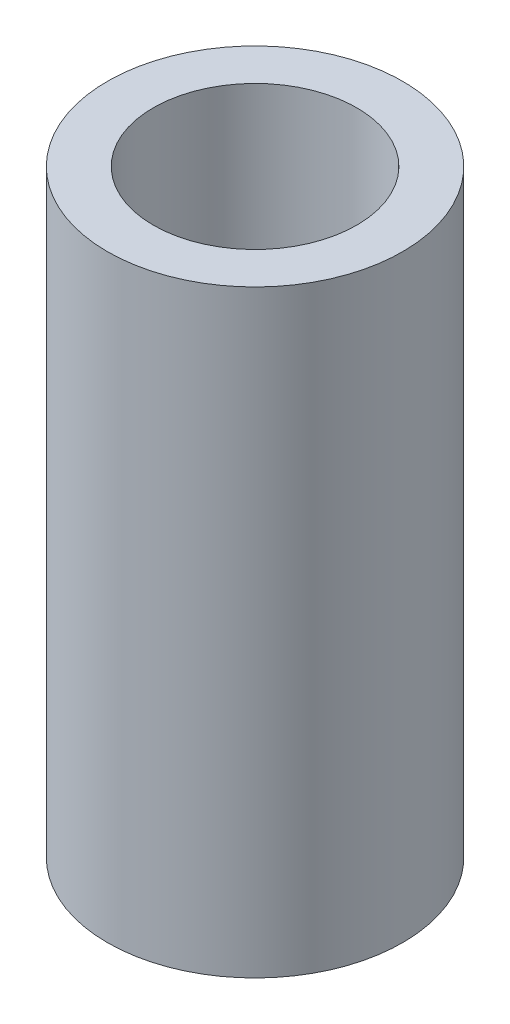
ISO-10303-21;
HEADER;
FILE_DESCRIPTION(('STEP AP214'),'2;1');
FILE_NAME('part.step','',(''),(''),'','','');
FILE_SCHEMA(('AUTOMOTIVE_DESIGN { 1 0 10303 214 1 1 1 1 }'));
ENDSEC;
DATA;
#1=APPLICATION_CONTEXT('core data for automotive mechanical design processes');
#2=APPLICATION_PROTOCOL_DEFINITION('international standard','automotive_design',2000,#1);
#3=PRODUCT_CONTEXT('',#1,'mechanical');
#4=PRODUCT('Part','Part','',(#3));
#5=PRODUCT_RELATED_PRODUCT_CATEGORY('part','',(#4));
#6=PRODUCT_DEFINITION_FORMATION('','',#4);
#7=PRODUCT_DEFINITION_CONTEXT('part definition',#1,'design');
#8=PRODUCT_DEFINITION('design','',#6,#7);
#9=PRODUCT_DEFINITION_SHAPE('','',#8);
#10=(LENGTH_UNIT() NAMED_UNIT(*) SI_UNIT(.MILLI.,.METRE.));
#11=(NAMED_UNIT(*) PLANE_ANGLE_UNIT() SI_UNIT($,.RADIAN.));
#12=(NAMED_UNIT(*) SI_UNIT($,.STERADIAN.) SOLID_ANGLE_UNIT());
#13=UNCERTAINTY_MEASURE_WITH_UNIT(LENGTH_MEASURE(1.E-05),#10,'distance_accuracy_value','');
#14=(GEOMETRIC_REPRESENTATION_CONTEXT(3) GLOBAL_UNCERTAINTY_ASSIGNED_CONTEXT((#13)) GLOBAL_UNIT_ASSIGNED_CONTEXT((#10,
#11,#12)) REPRESENTATION_CONTEXT('',''));
#15=CARTESIAN_POINT('',(0.,0.,0.));
#16=DIRECTION('',(0.,0.,1.));
#17=DIRECTION('',(1.,0.,0.));
#18=AXIS2_PLACEMENT_3D('',#15,#16,#17);
#19=CARTESIAN_POINT('',(0.,30.,0.));
#20=DIRECTION('',(0.,-1.,0.));
#21=DIRECTION('',(0.,0.,-1.));
#22=AXIS2_PLACEMENT_3D('',#19,#20,#21);
#23=CYLINDRICAL_SURFACE('',#22,7.4);
#24=CARTESIAN_POINT('',(0.,30.,0.));
#25=DIRECTION('',(0.,1.,0.));
#26=DIRECTION('',(0.,0.,1.));
#27=AXIS2_PLACEMENT_3D('',#24,#25,#26);
#28=CIRCLE('',#27,7.4);
#29=CARTESIAN_POINT('',(0.,30.,7.4));
#30=VERTEX_POINT('',#29);
#31=EDGE_CURVE('E10',#30,#30,#28,.T.);
#32=ORIENTED_EDGE('',*,*,#31,.F.);
#33=EDGE_LOOP('',(#32));
#34=FACE_BOUND('',#33,.T.);
#35=CARTESIAN_POINT('',(0.,0.,0.));
#36=DIRECTION('',(0.,1.,0.));
#37=DIRECTION('',(0.,0.,1.));
#38=AXIS2_PLACEMENT_3D('',#35,#36,#37);
#39=CIRCLE('',#38,7.4);
#40=CARTESIAN_POINT('',(0.,0.,7.4));
#41=VERTEX_POINT('',#40);
#42=EDGE_CURVE('E50',#41,#41,#39,.T.);
#43=ORIENTED_EDGE('',*,*,#42,.T.);
#44=EDGE_LOOP('',(#43));
#45=FACE_BOUND('',#44,.T.);
#46=ADVANCED_FACE('F47',(#34,#45),#23,.T.);
#47=CARTESIAN_POINT('',(0.,30.,0.));
#48=DIRECTION('',(0.,1.,0.));
#49=DIRECTION('',(0.,0.,1.));
#50=AXIS2_PLACEMENT_3D('',#47,#48,#49);
#51=PLANE('',#50);
#52=CARTESIAN_POINT('',(0.,30.,0.));
#53=DIRECTION('',(0.,1.,0.));
#54=DIRECTION('',(0.,0.,1.));
#55=AXIS2_PLACEMENT_3D('',#52,#53,#54);
#56=CIRCLE('',#55,5.09999999999999);
#57=CARTESIAN_POINT('',(0.,30.,5.09999999999999));
#58=VERTEX_POINT('',#57);
#59=EDGE_CURVE('E64',#58,#58,#56,.T.);
#60=ORIENTED_EDGE('',*,*,#59,.F.);
#61=EDGE_LOOP('',(#60));
#62=FACE_BOUND('',#61,.T.);
#63=ORIENTED_EDGE('',*,*,#31,.T.);
#64=EDGE_LOOP('',(#63));
#65=FACE_BOUND('',#64,.T.);
#66=ADVANCED_FACE('F71',(#62,#65),#51,.T.);
#67=CARTESIAN_POINT('',(0.,0.,0.));
#68=DIRECTION('',(0.,1.,0.));
#69=DIRECTION('',(0.,0.,1.));
#70=AXIS2_PLACEMENT_3D('',#67,#68,#69);
#71=PLANE('',#70);
#72=CARTESIAN_POINT('',(0.,0.,0.));
#73=DIRECTION('',(0.,1.,0.));
#74=DIRECTION('',(0.,0.,1.));
#75=AXIS2_PLACEMENT_3D('',#72,#73,#74);
#76=CIRCLE('',#75,5.09999999999999);
#77=CARTESIAN_POINT('',(0.,0.,5.09999999999999));
#78=VERTEX_POINT('',#77);
#79=EDGE_CURVE('E59',#78,#78,#76,.T.);
#80=ORIENTED_EDGE('',*,*,#79,.T.);
#81=EDGE_LOOP('',(#80));
#82=FACE_BOUND('',#81,.T.);
#83=ORIENTED_EDGE('',*,*,#42,.F.);
#84=EDGE_LOOP('',(#83));
#85=FACE_BOUND('',#84,.T.);
#86=ADVANCED_FACE('F73',(#82,#85),#71,.F.);
#87=CARTESIAN_POINT('',(0.,30.,0.));
#88=DIRECTION('',(0.,1.,0.));
#89=DIRECTION('',(0.,0.,1.));
#90=AXIS2_PLACEMENT_3D('',#87,#88,#89);
#91=CYLINDRICAL_SURFACE('',#90,5.09999999999999);
#92=ORIENTED_EDGE('',*,*,#79,.F.);
#93=EDGE_LOOP('',(#92));
#94=FACE_BOUND('',#93,.T.);
#95=ORIENTED_EDGE('',*,*,#59,.T.);
#96=EDGE_LOOP('',(#95));
#97=FACE_BOUND('',#96,.T.);
#98=ADVANCED_FACE('F69',(#94,#97),#91,.F.);
#99=CLOSED_SHELL('',(#46,#66,#86,#98));
#100=MANIFOLD_SOLID_BREP('B2',#99);
#101=ADVANCED_BREP_SHAPE_REPRESENTATION('',(#18,#100),#14);
#102=SHAPE_DEFINITION_REPRESENTATION(#9,#101);
ENDSEC;
END-ISO-10303-21;
